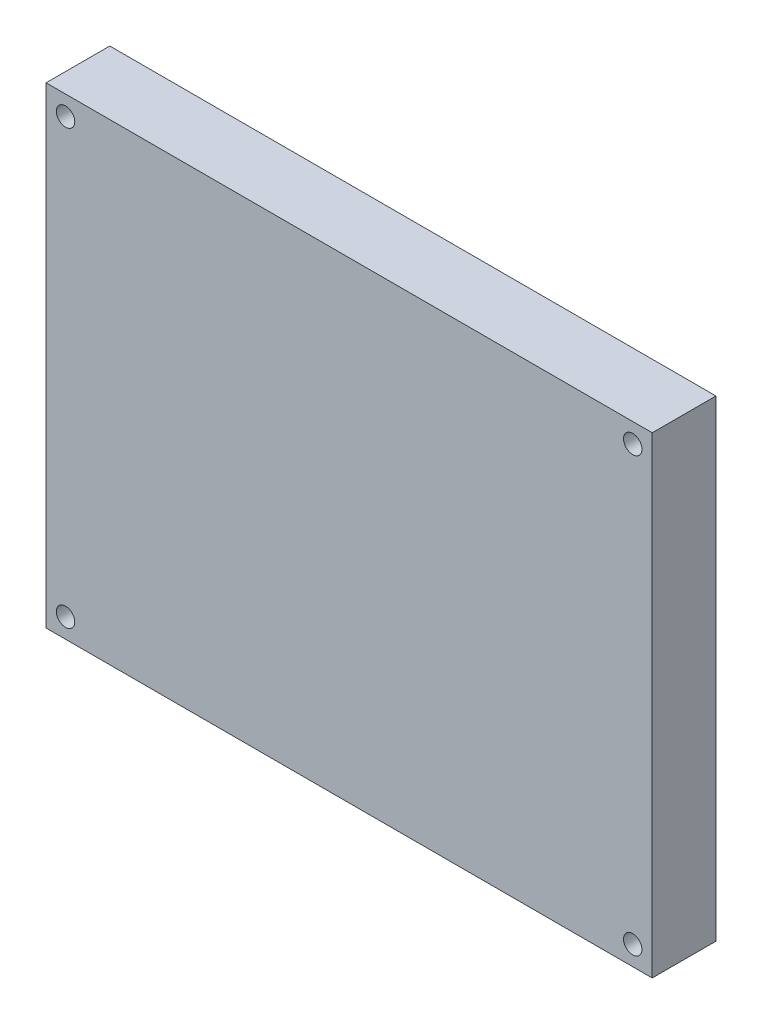
ISO-10303-21;
HEADER;
FILE_DESCRIPTION(('STEP AP214'),'2;1');
FILE_NAME('part.step','',(''),(''),'','','');
FILE_SCHEMA(('AUTOMOTIVE_DESIGN { 1 0 10303 214 1 1 1 1 }'));
ENDSEC;
DATA;
#1=APPLICATION_CONTEXT('core data for automotive mechanical design processes');
#2=APPLICATION_PROTOCOL_DEFINITION('international standard','automotive_design',2000,#1);
#3=PRODUCT_CONTEXT('',#1,'mechanical');
#4=PRODUCT('Part','Part','',(#3));
#5=PRODUCT_RELATED_PRODUCT_CATEGORY('part','',(#4));
#6=PRODUCT_DEFINITION_FORMATION('','',#4);
#7=PRODUCT_DEFINITION_CONTEXT('part definition',#1,'design');
#8=PRODUCT_DEFINITION('design','',#6,#7);
#9=PRODUCT_DEFINITION_SHAPE('','',#8);
#10=(LENGTH_UNIT() NAMED_UNIT(*) SI_UNIT(.MILLI.,.METRE.));
#11=(NAMED_UNIT(*) PLANE_ANGLE_UNIT() SI_UNIT($,.RADIAN.));
#12=(NAMED_UNIT(*) SI_UNIT($,.STERADIAN.) SOLID_ANGLE_UNIT());
#13=UNCERTAINTY_MEASURE_WITH_UNIT(LENGTH_MEASURE(1.E-05),#10,'distance_accuracy_value','');
#14=(GEOMETRIC_REPRESENTATION_CONTEXT(3) GLOBAL_UNCERTAINTY_ASSIGNED_CONTEXT((#13)) GLOBAL_UNIT_ASSIGNED_CONTEXT((#10,
#11,#12)) REPRESENTATION_CONTEXT('',''));
#15=CARTESIAN_POINT('',(0.,0.,0.));
#16=DIRECTION('',(0.,0.,1.));
#17=DIRECTION('',(1.,0.,0.));
#18=AXIS2_PLACEMENT_3D('',#15,#16,#17);
#19=CARTESIAN_POINT('',(0.,0.,10.));
#20=DIRECTION('',(0.,0.,1.));
#21=DIRECTION('',(1.,0.,0.));
#22=AXIS2_PLACEMENT_3D('',#19,#20,#21);
#23=PLANE('',#22);
#24=CARTESIAN_POINT('',(-89.4855018769961,-9.6032750628109,10.));
#25=DIRECTION('',(0.,0.,1.));
#26=DIRECTION('',(1.,0.,0.));
#27=AXIS2_PLACEMENT_3D('',#24,#25,#26);
#28=CIRCLE('',#27,1.44500000000001);
#29=CARTESIAN_POINT('',(-88.040501876996,-9.6032750628109,10.));
#30=VERTEX_POINT('',#29);
#31=EDGE_CURVE('E125',#30,#30,#28,.T.);
#32=ORIENTED_EDGE('',*,*,#31,.F.);
#33=EDGE_LOOP('',(#32));
#34=FACE_BOUND('',#33,.T.);
#35=CARTESIAN_POINT('',(-89.4855018769961,58.3967249371891,10.));
#36=DIRECTION('',(0.,0.,1.));
#37=DIRECTION('',(1.,0.,0.));
#38=AXIS2_PLACEMENT_3D('',#35,#36,#37);
#39=CIRCLE('',#38,1.44500000000001);
#40=CARTESIAN_POINT('',(-88.040501876996,58.3967249371891,10.));
#41=VERTEX_POINT('',#40);
#42=EDGE_CURVE('E126',#41,#41,#39,.T.);
#43=ORIENTED_EDGE('',*,*,#42,.F.);
#44=EDGE_LOOP('',(#43));
#45=FACE_BOUND('',#44,.T.);
#46=DIRECTION('',(0.,1.,0.));
#47=VECTOR('',#46,1.);
#48=CARTESIAN_POINT('',(2.60449812300397,61.4567249371891,10.));
#49=LINE('',#48,#47);
#50=CARTESIAN_POINT('',(2.60449812300398,-12.6632750628109,10.));
#51=VERTEX_POINT('',#50);
#52=CARTESIAN_POINT('',(2.60449812300397,61.4567249371891,10.));
#53=VERTEX_POINT('',#52);
#54=EDGE_CURVE('E90',#51,#53,#49,.T.);
#55=ORIENTED_EDGE('',*,*,#54,.T.);
#56=DIRECTION('',(-1.,0.,0.));
#57=VECTOR('',#56,1.);
#58=CARTESIAN_POINT('',(-92.545501876996,61.4567249371891,10.));
#59=LINE('',#58,#57);
#60=CARTESIAN_POINT('',(-92.545501876996,61.4567249371891,10.));
#61=VERTEX_POINT('',#60);
#62=EDGE_CURVE('E85',#53,#61,#59,.T.);
#63=ORIENTED_EDGE('',*,*,#62,.T.);
#64=DIRECTION('',(0.,-1.,0.));
#65=VECTOR('',#64,1.);
#66=CARTESIAN_POINT('',(-92.545501876996,61.4567249371891,10.));
#67=LINE('',#66,#65);
#68=CARTESIAN_POINT('',(-92.545501876996,-12.6632750628109,10.));
#69=VERTEX_POINT('',#68);
#70=EDGE_CURVE('E88',#61,#69,#67,.T.);
#71=ORIENTED_EDGE('',*,*,#70,.T.);
#72=DIRECTION('',(1.,0.,0.));
#73=VECTOR('',#72,1.);
#74=CARTESIAN_POINT('',(-92.545501876996,-12.6632750628109,10.));
#75=LINE('',#74,#73);
#76=EDGE_CURVE('E55',#69,#51,#75,.T.);
#77=ORIENTED_EDGE('',*,*,#76,.T.);
#78=EDGE_LOOP('',(#55,#63,#71,#77));
#79=FACE_BOUND('',#78,.T.);
#80=CARTESIAN_POINT('',(-0.455501876996031,58.3967249371891,10.));
#81=DIRECTION('',(0.,0.,1.));
#82=DIRECTION('',(1.,0.,0.));
#83=AXIS2_PLACEMENT_3D('',#80,#81,#82);
#84=CIRCLE('',#83,1.445);
#85=CARTESIAN_POINT('',(0.989498123003968,58.3967249371891,10.));
#86=VERTEX_POINT('',#85);
#87=EDGE_CURVE('E113',#86,#86,#84,.T.);
#88=ORIENTED_EDGE('',*,*,#87,.F.);
#89=EDGE_LOOP('',(#88));
#90=FACE_BOUND('',#89,.T.);
#91=CARTESIAN_POINT('',(-0.455501876996015,-9.6032750628109,10.));
#92=DIRECTION('',(0.,0.,1.));
#93=DIRECTION('',(1.,0.,0.));
#94=AXIS2_PLACEMENT_3D('',#91,#92,#93);
#95=CIRCLE('',#94,1.445);
#96=CARTESIAN_POINT('',(0.989498123003986,-9.6032750628109,10.));
#97=VERTEX_POINT('',#96);
#98=EDGE_CURVE('E240',#97,#97,#95,.T.);
#99=ORIENTED_EDGE('',*,*,#98,.F.);
#100=EDGE_LOOP('',(#99));
#101=FACE_BOUND('',#100,.T.);
#102=ADVANCED_FACE('F38',(#34,#45,#79,#90,#101),#23,.T.);
#103=CARTESIAN_POINT('',(0.,0.,0.));
#104=DIRECTION('',(0.,0.,1.));
#105=DIRECTION('',(1.,0.,0.));
#106=AXIS2_PLACEMENT_3D('',#103,#104,#105);
#107=PLANE('',#106);
#108=DIRECTION('',(0.,1.,0.));
#109=VECTOR('',#108,1.);
#110=CARTESIAN_POINT('',(2.60449812300397,61.4567249371891,0.));
#111=LINE('',#110,#109);
#112=CARTESIAN_POINT('',(2.60449812300398,-12.6632750628109,0.));
#113=VERTEX_POINT('',#112);
#114=CARTESIAN_POINT('',(2.60449812300397,61.4567249371891,0.));
#115=VERTEX_POINT('',#114);
#116=EDGE_CURVE('E131',#113,#115,#111,.T.);
#117=ORIENTED_EDGE('',*,*,#116,.F.);
#118=DIRECTION('',(1.,0.,0.));
#119=VECTOR('',#118,1.);
#120=CARTESIAN_POINT('',(-92.545501876996,-12.6632750628109,0.));
#121=LINE('',#120,#119);
#122=CARTESIAN_POINT('',(-92.545501876996,-12.6632750628109,0.));
#123=VERTEX_POINT('',#122);
#124=EDGE_CURVE('E78',#123,#113,#121,.T.);
#125=ORIENTED_EDGE('',*,*,#124,.F.);
#126=DIRECTION('',(0.,-1.,0.));
#127=VECTOR('',#126,1.);
#128=CARTESIAN_POINT('',(-92.545501876996,61.4567249371891,0.));
#129=LINE('',#128,#127);
#130=CARTESIAN_POINT('',(-92.545501876996,61.4567249371891,0.));
#131=VERTEX_POINT('',#130);
#132=EDGE_CURVE('E72',#131,#123,#129,.T.);
#133=ORIENTED_EDGE('',*,*,#132,.F.);
#134=DIRECTION('',(-1.,0.,0.));
#135=VECTOR('',#134,1.);
#136=CARTESIAN_POINT('',(-92.545501876996,61.4567249371891,0.));
#137=LINE('',#136,#135);
#138=EDGE_CURVE('E95',#115,#131,#137,.T.);
#139=ORIENTED_EDGE('',*,*,#138,.F.);
#140=EDGE_LOOP('',(#117,#125,#133,#139));
#141=FACE_BOUND('',#140,.T.);
#142=CARTESIAN_POINT('',(-89.4855018769961,58.3967249371891,0.));
#143=DIRECTION('',(0.,0.,1.));
#144=DIRECTION('',(1.,0.,0.));
#145=AXIS2_PLACEMENT_3D('',#142,#143,#144);
#146=CIRCLE('',#145,1.44500000000001);
#147=CARTESIAN_POINT('',(-88.040501876996,58.3967249371891,0.));
#148=VERTEX_POINT('',#147);
#149=EDGE_CURVE('E119',#148,#148,#146,.T.);
#150=ORIENTED_EDGE('',*,*,#149,.T.);
#151=EDGE_LOOP('',(#150));
#152=FACE_BOUND('',#151,.T.);
#153=CARTESIAN_POINT('',(-0.455501876996031,58.3967249371891,0.));
#154=DIRECTION('',(0.,0.,1.));
#155=DIRECTION('',(1.,0.,0.));
#156=AXIS2_PLACEMENT_3D('',#153,#154,#155);
#157=CIRCLE('',#156,1.445);
#158=CARTESIAN_POINT('',(0.989498123003968,58.3967249371891,0.));
#159=VERTEX_POINT('',#158);
#160=EDGE_CURVE('E120',#159,#159,#157,.T.);
#161=ORIENTED_EDGE('',*,*,#160,.T.);
#162=EDGE_LOOP('',(#161));
#163=FACE_BOUND('',#162,.T.);
#164=CARTESIAN_POINT('',(-89.4855018769961,-9.6032750628109,0.));
#165=DIRECTION('',(0.,0.,1.));
#166=DIRECTION('',(1.,0.,0.));
#167=AXIS2_PLACEMENT_3D('',#164,#165,#166);
#168=CIRCLE('',#167,1.44500000000001);
#169=CARTESIAN_POINT('',(-88.040501876996,-9.6032750628109,0.));
#170=VERTEX_POINT('',#169);
#171=EDGE_CURVE('E121',#170,#170,#168,.T.);
#172=ORIENTED_EDGE('',*,*,#171,.T.);
#173=EDGE_LOOP('',(#172));
#174=FACE_BOUND('',#173,.T.);
#175=CARTESIAN_POINT('',(-0.455501876996015,-9.6032750628109,0.));
#176=DIRECTION('',(0.,0.,1.));
#177=DIRECTION('',(1.,0.,0.));
#178=AXIS2_PLACEMENT_3D('',#175,#176,#177);
#179=CIRCLE('',#178,1.445);
#180=CARTESIAN_POINT('',(0.989498123003986,-9.6032750628109,0.));
#181=VERTEX_POINT('',#180);
#182=EDGE_CURVE('E243',#181,#181,#179,.T.);
#183=ORIENTED_EDGE('',*,*,#182,.T.);
#184=EDGE_LOOP('',(#183));
#185=FACE_BOUND('',#184,.T.);
#186=ADVANCED_FACE('F144',(#141,#152,#163,#174,#185),#107,.F.);
#187=CARTESIAN_POINT('',(2.60449812300397,61.4567249371891,10.));
#188=DIRECTION('',(-1.,0.,0.));
#189=DIRECTION('',(0.,-1.,0.));
#190=AXIS2_PLACEMENT_3D('',#187,#188,#189);
#191=PLANE('',#190);
#192=ORIENTED_EDGE('',*,*,#116,.T.);
#193=DIRECTION('',(0.,0.,-1.));
#194=VECTOR('',#193,1.);
#195=CARTESIAN_POINT('',(2.60449812300397,61.4567249371891,10.));
#196=LINE('',#195,#194);
#197=EDGE_CURVE('E12',#53,#115,#196,.T.);
#198=ORIENTED_EDGE('',*,*,#197,.F.);
#199=ORIENTED_EDGE('',*,*,#54,.F.);
#200=DIRECTION('',(0.,0.,-1.));
#201=VECTOR('',#200,1.);
#202=CARTESIAN_POINT('',(2.60449812300398,-12.6632750628109,10.));
#203=LINE('',#202,#201);
#204=EDGE_CURVE('E101',#51,#113,#203,.T.);
#205=ORIENTED_EDGE('',*,*,#204,.T.);
#206=EDGE_LOOP('',(#192,#198,#199,#205));
#207=FACE_BOUND('',#206,.T.);
#208=ADVANCED_FACE('F40',(#207),#191,.F.);
#209=CARTESIAN_POINT('',(-92.545501876996,61.4567249371891,10.));
#210=DIRECTION('',(0.,-1.,0.));
#211=DIRECTION('',(0.,0.,-1.));
#212=AXIS2_PLACEMENT_3D('',#209,#210,#211);
#213=PLANE('',#212);
#214=ORIENTED_EDGE('',*,*,#138,.T.);
#215=DIRECTION('',(0.,0.,-1.));
#216=VECTOR('',#215,1.);
#217=CARTESIAN_POINT('',(-92.545501876996,61.4567249371891,10.));
#218=LINE('',#217,#216);
#219=EDGE_CURVE('E47',#61,#131,#218,.T.);
#220=ORIENTED_EDGE('',*,*,#219,.F.);
#221=ORIENTED_EDGE('',*,*,#62,.F.);
#222=ORIENTED_EDGE('',*,*,#197,.T.);
#223=EDGE_LOOP('',(#214,#220,#221,#222));
#224=FACE_BOUND('',#223,.T.);
#225=ADVANCED_FACE('F94',(#224),#213,.F.);
#226=CARTESIAN_POINT('',(-92.545501876996,61.4567249371891,10.));
#227=DIRECTION('',(1.,0.,0.));
#228=DIRECTION('',(0.,1.,0.));
#229=AXIS2_PLACEMENT_3D('',#226,#227,#228);
#230=PLANE('',#229);
#231=ORIENTED_EDGE('',*,*,#132,.T.);
#232=DIRECTION('',(0.,0.,-1.));
#233=VECTOR('',#232,1.);
#234=CARTESIAN_POINT('',(-92.545501876996,-12.6632750628109,10.));
#235=LINE('',#234,#233);
#236=EDGE_CURVE('E96',#69,#123,#235,.T.);
#237=ORIENTED_EDGE('',*,*,#236,.F.);
#238=ORIENTED_EDGE('',*,*,#70,.F.);
#239=ORIENTED_EDGE('',*,*,#219,.T.);
#240=EDGE_LOOP('',(#231,#237,#238,#239));
#241=FACE_BOUND('',#240,.T.);
#242=ADVANCED_FACE('F97',(#241),#230,.F.);
#243=CARTESIAN_POINT('',(-92.545501876996,-12.6632750628109,10.));
#244=DIRECTION('',(0.,1.,0.));
#245=DIRECTION('',(0.,0.,1.));
#246=AXIS2_PLACEMENT_3D('',#243,#244,#245);
#247=PLANE('',#246);
#248=ORIENTED_EDGE('',*,*,#124,.T.);
#249=ORIENTED_EDGE('',*,*,#204,.F.);
#250=ORIENTED_EDGE('',*,*,#76,.F.);
#251=ORIENTED_EDGE('',*,*,#236,.T.);
#252=EDGE_LOOP('',(#248,#249,#250,#251));
#253=FACE_BOUND('',#252,.T.);
#254=ADVANCED_FACE('F141',(#253),#247,.F.);
#255=CARTESIAN_POINT('',(-89.4855018769961,58.3967249371891,10.));
#256=DIRECTION('',(0.,0.,-1.));
#257=DIRECTION('',(-1.,0.,0.));
#258=AXIS2_PLACEMENT_3D('',#255,#256,#257);
#259=CYLINDRICAL_SURFACE('',#258,1.44500000000001);
#260=ORIENTED_EDGE('',*,*,#42,.T.);
#261=EDGE_LOOP('',(#260));
#262=FACE_BOUND('',#261,.T.);
#263=ORIENTED_EDGE('',*,*,#149,.F.);
#264=EDGE_LOOP('',(#263));
#265=FACE_BOUND('',#264,.T.);
#266=ADVANCED_FACE('F162',(#262,#265),#259,.F.);
#267=CARTESIAN_POINT('',(-0.455501876996031,58.3967249371891,10.));
#268=DIRECTION('',(0.,0.,-1.));
#269=DIRECTION('',(-1.,0.,0.));
#270=AXIS2_PLACEMENT_3D('',#267,#268,#269);
#271=CYLINDRICAL_SURFACE('',#270,1.445);
#272=ORIENTED_EDGE('',*,*,#87,.T.);
#273=EDGE_LOOP('',(#272));
#274=FACE_BOUND('',#273,.T.);
#275=ORIENTED_EDGE('',*,*,#160,.F.);
#276=EDGE_LOOP('',(#275));
#277=FACE_BOUND('',#276,.T.);
#278=ADVANCED_FACE('F182',(#274,#277),#271,.F.);
#279=CARTESIAN_POINT('',(-89.4855018769961,-9.6032750628109,10.));
#280=DIRECTION('',(0.,0.,-1.));
#281=DIRECTION('',(-1.,0.,0.));
#282=AXIS2_PLACEMENT_3D('',#279,#280,#281);
#283=CYLINDRICAL_SURFACE('',#282,1.44500000000001);
#284=ORIENTED_EDGE('',*,*,#31,.T.);
#285=EDGE_LOOP('',(#284));
#286=FACE_BOUND('',#285,.T.);
#287=ORIENTED_EDGE('',*,*,#171,.F.);
#288=EDGE_LOOP('',(#287));
#289=FACE_BOUND('',#288,.T.);
#290=ADVANCED_FACE('F189',(#286,#289),#283,.F.);
#291=CARTESIAN_POINT('',(-0.455501876996015,-9.6032750628109,10.));
#292=DIRECTION('',(0.,0.,-1.));
#293=DIRECTION('',(-1.,0.,0.));
#294=AXIS2_PLACEMENT_3D('',#291,#292,#293);
#295=CYLINDRICAL_SURFACE('',#294,1.445);
#296=ORIENTED_EDGE('',*,*,#98,.T.);
#297=EDGE_LOOP('',(#296));
#298=FACE_BOUND('',#297,.T.);
#299=ORIENTED_EDGE('',*,*,#182,.F.);
#300=EDGE_LOOP('',(#299));
#301=FACE_BOUND('',#300,.T.);
#302=ADVANCED_FACE('F196',(#298,#301),#295,.F.);
#303=CLOSED_SHELL('',(#102,#186,#208,#225,#242,#254,#266,#278,#290,#302));
#304=MANIFOLD_SOLID_BREP('B2',#303);
#305=ADVANCED_BREP_SHAPE_REPRESENTATION('',(#18,#304),#14);
#306=SHAPE_DEFINITION_REPRESENTATION(#9,#305);
ENDSEC;
END-ISO-10303-21;
